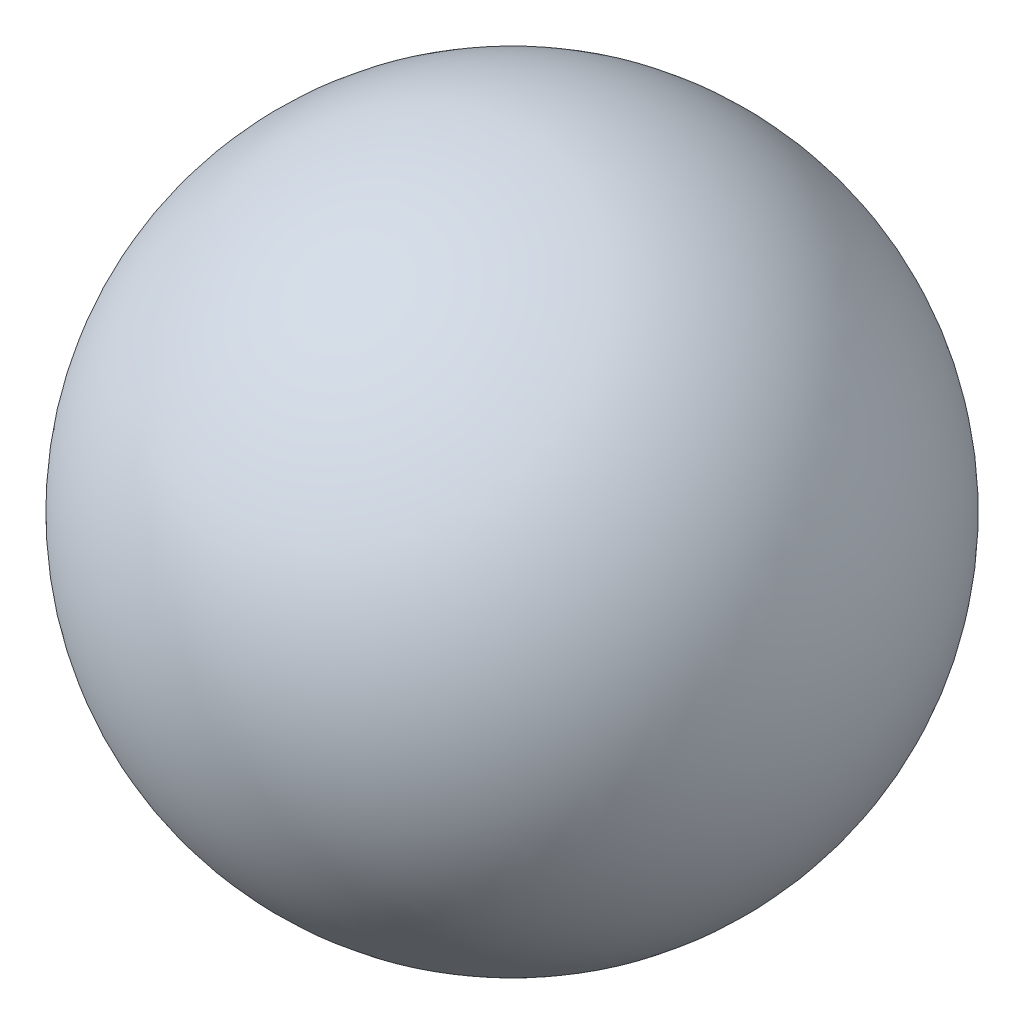
ISO-10303-21;
HEADER;
FILE_DESCRIPTION(('STEP AP214'),'2;1');
FILE_NAME('part.step','',(''),(''),'','','');
FILE_SCHEMA(('AUTOMOTIVE_DESIGN { 1 0 10303 214 1 1 1 1 }'));
ENDSEC;
DATA;
#1=APPLICATION_CONTEXT('core data for automotive mechanical design processes');
#2=APPLICATION_PROTOCOL_DEFINITION('international standard','automotive_design',2000,#1);
#3=PRODUCT_CONTEXT('',#1,'mechanical');
#4=PRODUCT('Part','Part','',(#3));
#5=PRODUCT_RELATED_PRODUCT_CATEGORY('part','',(#4));
#6=PRODUCT_DEFINITION_FORMATION('','',#4);
#7=PRODUCT_DEFINITION_CONTEXT('part definition',#1,'design');
#8=PRODUCT_DEFINITION('design','',#6,#7);
#9=PRODUCT_DEFINITION_SHAPE('','',#8);
#10=(LENGTH_UNIT() NAMED_UNIT(*) SI_UNIT(.MILLI.,.METRE.));
#11=(NAMED_UNIT(*) PLANE_ANGLE_UNIT() SI_UNIT($,.RADIAN.));
#12=(NAMED_UNIT(*) SI_UNIT($,.STERADIAN.) SOLID_ANGLE_UNIT());
#13=UNCERTAINTY_MEASURE_WITH_UNIT(LENGTH_MEASURE(1.E-05),#10,'distance_accuracy_value','');
#14=(GEOMETRIC_REPRESENTATION_CONTEXT(3) GLOBAL_UNCERTAINTY_ASSIGNED_CONTEXT((#13)) GLOBAL_UNIT_ASSIGNED_CONTEXT((#10,
#11,#12)) REPRESENTATION_CONTEXT('',''));
#15=CARTESIAN_POINT('',(0.,0.,0.));
#16=DIRECTION('',(0.,0.,1.));
#17=DIRECTION('',(1.,0.,0.));
#18=AXIS2_PLACEMENT_3D('',#15,#16,#17);
#19=CARTESIAN_POINT('',(0.,0.,0.));
#20=DIRECTION('',(0.,1.,0.));
#21=DIRECTION('',(-1.,0.,0.));
#22=AXIS2_PLACEMENT_3D('',#19,#20,#21);
#23=SPHERICAL_SURFACE('',#22,10.);
#24=CARTESIAN_POINT('',(0.,10.,0.));
#25=VERTEX_POINT('',#24);
#26=VERTEX_LOOP('',#25);
#27=FACE_BOUND('',#26,.T.);
#28=ADVANCED_FACE('F45',(#27),#23,.T.);
#29=CLOSED_SHELL('',(#28));
#30=MANIFOLD_SOLID_BREP('B2',#29);
#31=CARTESIAN_POINT('',(0.,0.,2.5));
#32=DIRECTION('',(0.,0.,-1.));
#33=DIRECTION('',(-1.,0.,0.));
#34=AXIS2_PLACEMENT_3D('',#31,#32,#33);
#35=CYLINDRICAL_SURFACE('',#34,2.5);
#36=CARTESIAN_POINT('',(0.,0.,-2.5));
#37=DIRECTION('',(0.,0.,-1.));
#38=DIRECTION('',(1.,0.,0.));
#39=AXIS2_PLACEMENT_3D('',#36,#37,#38);
#40=CIRCLE('',#39,2.5);
#41=CARTESIAN_POINT('',(2.5,0.,-2.5));
#42=VERTEX_POINT('',#41);
#43=CARTESIAN_POINT('',(-2.5,0.,-2.5));
#44=VERTEX_POINT('',#43);
#45=EDGE_CURVE('E168',#42,#44,#40,.T.);
#46=ORIENTED_EDGE('',*,*,#45,.T.);
#47=DIRECTION('',(0.,0.,-1.));
#48=VECTOR('',#47,1.);
#49=CARTESIAN_POINT('',(-2.5,0.,2.5));
#50=LINE('',#49,#48);
#51=CARTESIAN_POINT('',(-2.5,0.,2.5));
#52=VERTEX_POINT('',#51);
#53=EDGE_CURVE('E43',#52,#44,#50,.T.);
#54=ORIENTED_EDGE('',*,*,#53,.F.);
#55=CARTESIAN_POINT('',(0.,0.,2.5));
#56=DIRECTION('',(0.,0.,-1.));
#57=DIRECTION('',(1.,0.,0.));
#58=AXIS2_PLACEMENT_3D('',#55,#56,#57);
#59=CIRCLE('',#58,2.5);
#60=CARTESIAN_POINT('',(2.5,0.,2.5));
#61=VERTEX_POINT('',#60);
#62=EDGE_CURVE('E188',#61,#52,#59,.T.);
#63=ORIENTED_EDGE('',*,*,#62,.F.);
#64=DIRECTION('',(0.,0.,-1.));
#65=VECTOR('',#64,1.);
#66=CARTESIAN_POINT('',(2.5,0.,2.5));
#67=LINE('',#66,#65);
#68=EDGE_CURVE('E164',#61,#42,#67,.T.);
#69=ORIENTED_EDGE('',*,*,#68,.T.);
#70=EDGE_LOOP('',(#46,#54,#63,#69));
#71=FACE_BOUND('',#70,.T.);
#72=ADVANCED_FACE('F59',(#71),#35,.F.);
#73=CARTESIAN_POINT('',(-2.5,5.00000000000002,2.5));
#74=DIRECTION('',(-1.,0.,0.));
#75=DIRECTION('',(0.,-1.,0.));
#76=AXIS2_PLACEMENT_3D('',#73,#74,#75);
#77=PLANE('',#76);
#78=DIRECTION('',(0.,1.,0.));
#79=VECTOR('',#78,1.);
#80=CARTESIAN_POINT('',(-2.5,5.00000000000002,-2.5));
#81=LINE('',#80,#79);
#82=CARTESIAN_POINT('',(-2.5,5.00000000000002,-2.5));
#83=VERTEX_POINT('',#82);
#84=EDGE_CURVE('E172',#44,#83,#81,.T.);
#85=ORIENTED_EDGE('',*,*,#84,.T.);
#86=DIRECTION('',(0.,0.,-1.));
#87=VECTOR('',#86,1.);
#88=CARTESIAN_POINT('',(-2.5,5.00000000000002,2.5));
#89=LINE('',#88,#87);
#90=CARTESIAN_POINT('',(-2.5,5.00000000000002,2.5));
#91=VERTEX_POINT('',#90);
#92=EDGE_CURVE('E67',#91,#83,#89,.T.);
#93=ORIENTED_EDGE('',*,*,#92,.F.);
#94=DIRECTION('',(0.,1.,0.));
#95=VECTOR('',#94,1.);
#96=CARTESIAN_POINT('',(-2.5,5.00000000000002,2.5));
#97=LINE('',#96,#95);
#98=EDGE_CURVE('E124',#52,#91,#97,.T.);
#99=ORIENTED_EDGE('',*,*,#98,.F.);
#100=ORIENTED_EDGE('',*,*,#53,.T.);
#101=EDGE_LOOP('',(#85,#93,#99,#100));
#102=FACE_BOUND('',#101,.T.);
#103=ADVANCED_FACE('F237',(#102),#77,.F.);
#104=CARTESIAN_POINT('',(-5.,5.00000000000002,2.5));
#105=DIRECTION('',(0.,-1.,0.));
#106=DIRECTION('',(0.,0.,-1.));
#107=AXIS2_PLACEMENT_3D('',#104,#105,#106);
#108=PLANE('',#107);
#109=DIRECTION('',(-1.,0.,0.));
#110=VECTOR('',#109,1.);
#111=CARTESIAN_POINT('',(-5.,5.00000000000002,-2.5));
#112=LINE('',#111,#110);
#113=CARTESIAN_POINT('',(-5.,5.00000000000002,-2.5));
#114=VERTEX_POINT('',#113);
#115=EDGE_CURVE('E174',#83,#114,#112,.T.);
#116=ORIENTED_EDGE('',*,*,#115,.T.);
#117=DIRECTION('',(0.,0.,-1.));
#118=VECTOR('',#117,1.);
#119=CARTESIAN_POINT('',(-5.,5.00000000000002,2.5));
#120=LINE('',#119,#118);
#121=CARTESIAN_POINT('',(-5.,5.00000000000002,2.5));
#122=VERTEX_POINT('',#121);
#123=EDGE_CURVE('E201',#122,#114,#120,.T.);
#124=ORIENTED_EDGE('',*,*,#123,.F.);
#125=DIRECTION('',(-1.,0.,0.));
#126=VECTOR('',#125,1.);
#127=CARTESIAN_POINT('',(-5.,5.00000000000002,2.5));
#128=LINE('',#127,#126);
#129=EDGE_CURVE('E209',#91,#122,#128,.T.);
#130=ORIENTED_EDGE('',*,*,#129,.F.);
#131=ORIENTED_EDGE('',*,*,#92,.T.);
#132=EDGE_LOOP('',(#116,#124,#130,#131));
#133=FACE_BOUND('',#132,.T.);
#134=ADVANCED_FACE('F207',(#133),#108,.F.);
#135=CARTESIAN_POINT('',(-5.,0.,2.5));
#136=DIRECTION('',(1.,0.,0.));
#137=DIRECTION('',(0.,1.,0.));
#138=AXIS2_PLACEMENT_3D('',#135,#136,#137);
#139=PLANE('',#138);
#140=DIRECTION('',(0.,-1.,0.));
#141=VECTOR('',#140,1.);
#142=CARTESIAN_POINT('',(-5.,0.,-2.5));
#143=LINE('',#142,#141);
#144=CARTESIAN_POINT('',(-5.,0.,-2.5));
#145=VERTEX_POINT('',#144);
#146=EDGE_CURVE('E176',#114,#145,#143,.T.);
#147=ORIENTED_EDGE('',*,*,#146,.T.);
#148=DIRECTION('',(0.,0.,-1.));
#149=VECTOR('',#148,1.);
#150=CARTESIAN_POINT('',(-5.,0.,2.5));
#151=LINE('',#150,#149);
#152=CARTESIAN_POINT('',(-5.,0.,2.5));
#153=VERTEX_POINT('',#152);
#154=EDGE_CURVE('E198',#153,#145,#151,.T.);
#155=ORIENTED_EDGE('',*,*,#154,.F.);
#156=DIRECTION('',(0.,-1.,0.));
#157=VECTOR('',#156,1.);
#158=CARTESIAN_POINT('',(-5.,0.,2.5));
#159=LINE('',#158,#157);
#160=EDGE_CURVE('E227',#122,#153,#159,.T.);
#161=ORIENTED_EDGE('',*,*,#160,.F.);
#162=ORIENTED_EDGE('',*,*,#123,.T.);
#163=EDGE_LOOP('',(#147,#155,#161,#162));
#164=FACE_BOUND('',#163,.T.);
#165=ADVANCED_FACE('F218',(#164),#139,.F.);
#166=CARTESIAN_POINT('',(0.,0.,2.5));
#167=DIRECTION('',(0.,0.,-1.));
#168=DIRECTION('',(-1.,0.,0.));
#169=AXIS2_PLACEMENT_3D('',#166,#167,#168);
#170=CYLINDRICAL_SURFACE('',#169,5.);
#171=CARTESIAN_POINT('',(0.,0.,-2.5));
#172=DIRECTION('',(0.,0.,1.));
#173=DIRECTION('',(1.,0.,0.));
#174=AXIS2_PLACEMENT_3D('',#171,#172,#173);
#175=CIRCLE('',#174,5.);
#176=CARTESIAN_POINT('',(2.5,-4.33012701892219,-2.5));
#177=VERTEX_POINT('',#176);
#178=EDGE_CURVE('E178',#145,#177,#175,.T.);
#179=ORIENTED_EDGE('',*,*,#178,.T.);
#180=DIRECTION('',(0.,0.,-1.));
#181=VECTOR('',#180,1.);
#182=CARTESIAN_POINT('',(2.5,-4.33012701892219,2.5));
#183=LINE('',#182,#181);
#184=CARTESIAN_POINT('',(2.5,-4.33012701892219,2.5));
#185=VERTEX_POINT('',#184);
#186=EDGE_CURVE('E195',#185,#177,#183,.T.);
#187=ORIENTED_EDGE('',*,*,#186,.F.);
#188=CARTESIAN_POINT('',(0.,0.,2.5));
#189=DIRECTION('',(0.,0.,1.));
#190=DIRECTION('',(1.,0.,0.));
#191=AXIS2_PLACEMENT_3D('',#188,#189,#190);
#192=CIRCLE('',#191,5.);
#193=EDGE_CURVE('E224',#153,#185,#192,.T.);
#194=ORIENTED_EDGE('',*,*,#193,.F.);
#195=ORIENTED_EDGE('',*,*,#154,.T.);
#196=EDGE_LOOP('',(#179,#187,#194,#195));
#197=FACE_BOUND('',#196,.T.);
#198=ADVANCED_FACE('F222',(#197),#170,.T.);
#199=CARTESIAN_POINT('',(2.5,-5.,2.5));
#200=DIRECTION('',(1.,0.,0.));
#201=DIRECTION('',(0.,0.,-1.));
#202=AXIS2_PLACEMENT_3D('',#199,#200,#201);
#203=PLANE('',#202);
#204=DIRECTION('',(0.,-1.,0.));
#205=VECTOR('',#204,1.);
#206=CARTESIAN_POINT('',(2.5,-5.,-2.5));
#207=LINE('',#206,#205);
#208=CARTESIAN_POINT('',(2.5,-5.,-2.5));
#209=VERTEX_POINT('',#208);
#210=EDGE_CURVE('E181',#177,#209,#207,.T.);
#211=ORIENTED_EDGE('',*,*,#210,.T.);
#212=DIRECTION('',(0.,0.,-1.));
#213=VECTOR('',#212,1.);
#214=CARTESIAN_POINT('',(2.5,-5.,2.5));
#215=LINE('',#214,#213);
#216=CARTESIAN_POINT('',(2.5,-5.,2.5));
#217=VERTEX_POINT('',#216);
#218=EDGE_CURVE('E192',#217,#209,#215,.T.);
#219=ORIENTED_EDGE('',*,*,#218,.F.);
#220=DIRECTION('',(0.,-1.,0.));
#221=VECTOR('',#220,1.);
#222=CARTESIAN_POINT('',(2.5,-5.,2.5));
#223=LINE('',#222,#221);
#224=EDGE_CURVE('E226',#185,#217,#223,.T.);
#225=ORIENTED_EDGE('',*,*,#224,.F.);
#226=ORIENTED_EDGE('',*,*,#186,.T.);
#227=EDGE_LOOP('',(#211,#219,#225,#226));
#228=FACE_BOUND('',#227,.T.);
#229=ADVANCED_FACE('F249',(#228),#203,.F.);
#230=CARTESIAN_POINT('',(5.,-5.,2.5));
#231=DIRECTION('',(0.,1.,0.));
#232=DIRECTION('',(0.,0.,1.));
#233=AXIS2_PLACEMENT_3D('',#230,#231,#232);
#234=PLANE('',#233);
#235=DIRECTION('',(1.,0.,0.));
#236=VECTOR('',#235,1.);
#237=CARTESIAN_POINT('',(5.,-5.,-2.5));
#238=LINE('',#237,#236);
#239=CARTESIAN_POINT('',(5.,-5.,-2.5));
#240=VERTEX_POINT('',#239);
#241=EDGE_CURVE('E183',#209,#240,#238,.T.);
#242=ORIENTED_EDGE('',*,*,#241,.T.);
#243=DIRECTION('',(0.,0.,-1.));
#244=VECTOR('',#243,1.);
#245=CARTESIAN_POINT('',(5.,-5.,2.5));
#246=LINE('',#245,#244);
#247=CARTESIAN_POINT('',(5.,-5.,2.5));
#248=VERTEX_POINT('',#247);
#249=EDGE_CURVE('E158',#248,#240,#246,.T.);
#250=ORIENTED_EDGE('',*,*,#249,.F.);
#251=DIRECTION('',(1.,0.,0.));
#252=VECTOR('',#251,1.);
#253=CARTESIAN_POINT('',(5.,-5.,2.5));
#254=LINE('',#253,#252);
#255=EDGE_CURVE('E149',#217,#248,#254,.T.);
#256=ORIENTED_EDGE('',*,*,#255,.F.);
#257=ORIENTED_EDGE('',*,*,#218,.T.);
#258=EDGE_LOOP('',(#242,#250,#256,#257));
#259=FACE_BOUND('',#258,.T.);
#260=ADVANCED_FACE('F252',(#259),#234,.F.);
#261=CARTESIAN_POINT('',(5.,5.00000000000002,2.5));
#262=DIRECTION('',(-1.,0.,0.));
#263=DIRECTION('',(0.,0.,1.));
#264=AXIS2_PLACEMENT_3D('',#261,#262,#263);
#265=PLANE('',#264);
#266=DIRECTION('',(0.,1.,0.));
#267=VECTOR('',#266,1.);
#268=CARTESIAN_POINT('',(5.,5.00000000000002,-2.5));
#269=LINE('',#268,#267);
#270=CARTESIAN_POINT('',(5.,5.00000000000002,-2.5));
#271=VERTEX_POINT('',#270);
#272=EDGE_CURVE('E157',#240,#271,#269,.T.);
#273=ORIENTED_EDGE('',*,*,#272,.T.);
#274=DIRECTION('',(0.,0.,-1.));
#275=VECTOR('',#274,1.);
#276=CARTESIAN_POINT('',(5.,5.00000000000002,2.5));
#277=LINE('',#276,#275);
#278=CARTESIAN_POINT('',(5.,5.00000000000002,2.5));
#279=VERTEX_POINT('',#278);
#280=EDGE_CURVE('E154',#279,#271,#277,.T.);
#281=ORIENTED_EDGE('',*,*,#280,.F.);
#282=DIRECTION('',(0.,1.,0.));
#283=VECTOR('',#282,1.);
#284=CARTESIAN_POINT('',(5.,5.00000000000002,2.5));
#285=LINE('',#284,#283);
#286=EDGE_CURVE('E143',#248,#279,#285,.T.);
#287=ORIENTED_EDGE('',*,*,#286,.F.);
#288=ORIENTED_EDGE('',*,*,#249,.T.);
#289=EDGE_LOOP('',(#273,#281,#287,#288));
#290=FACE_BOUND('',#289,.T.);
#291=ADVANCED_FACE('F155',(#290),#265,.F.);
#292=CARTESIAN_POINT('',(2.5,5.00000000000002,2.5));
#293=DIRECTION('',(0.,-1.,0.));
#294=DIRECTION('',(0.,0.,-1.));
#295=AXIS2_PLACEMENT_3D('',#292,#293,#294);
#296=PLANE('',#295);
#297=DIRECTION('',(-1.,0.,0.));
#298=VECTOR('',#297,1.);
#299=CARTESIAN_POINT('',(2.5,5.00000000000002,-2.5));
#300=LINE('',#299,#298);
#301=CARTESIAN_POINT('',(2.5,5.00000000000002,-2.5));
#302=VERTEX_POINT('',#301);
#303=EDGE_CURVE('E110',#271,#302,#300,.T.);
#304=ORIENTED_EDGE('',*,*,#303,.T.);
#305=DIRECTION('',(0.,0.,-1.));
#306=VECTOR('',#305,1.);
#307=CARTESIAN_POINT('',(2.5,5.00000000000002,2.5));
#308=LINE('',#307,#306);
#309=CARTESIAN_POINT('',(2.5,5.00000000000002,2.5));
#310=VERTEX_POINT('',#309);
#311=EDGE_CURVE('E159',#310,#302,#308,.T.);
#312=ORIENTED_EDGE('',*,*,#311,.F.);
#313=DIRECTION('',(-1.,0.,0.));
#314=VECTOR('',#313,1.);
#315=CARTESIAN_POINT('',(2.5,5.00000000000002,2.5));
#316=LINE('',#315,#314);
#317=EDGE_CURVE('E147',#279,#310,#316,.T.);
#318=ORIENTED_EDGE('',*,*,#317,.F.);
#319=ORIENTED_EDGE('',*,*,#280,.T.);
#320=EDGE_LOOP('',(#304,#312,#318,#319));
#321=FACE_BOUND('',#320,.T.);
#322=ADVANCED_FACE('F161',(#321),#296,.F.);
#323=CARTESIAN_POINT('',(2.5,0.,2.5));
#324=DIRECTION('',(1.,0.,0.));
#325=DIRECTION('',(0.,1.,0.));
#326=AXIS2_PLACEMENT_3D('',#323,#324,#325);
#327=PLANE('',#326);
#328=DIRECTION('',(0.,-1.,0.));
#329=VECTOR('',#328,1.);
#330=CARTESIAN_POINT('',(2.5,0.,-2.5));
#331=LINE('',#330,#329);
#332=EDGE_CURVE('E116',#302,#42,#331,.T.);
#333=ORIENTED_EDGE('',*,*,#332,.T.);
#334=ORIENTED_EDGE('',*,*,#68,.F.);
#335=DIRECTION('',(0.,-1.,0.));
#336=VECTOR('',#335,1.);
#337=CARTESIAN_POINT('',(2.5,0.,2.5));
#338=LINE('',#337,#336);
#339=EDGE_CURVE('E75',#310,#61,#338,.T.);
#340=ORIENTED_EDGE('',*,*,#339,.F.);
#341=ORIENTED_EDGE('',*,*,#311,.T.);
#342=EDGE_LOOP('',(#333,#334,#340,#341));
#343=FACE_BOUND('',#342,.T.);
#344=ADVANCED_FACE('F261',(#343),#327,.F.);
#345=CARTESIAN_POINT('',(0.,0.,2.5));
#346=DIRECTION('',(0.,0.,1.));
#347=DIRECTION('',(1.,0.,0.));
#348=AXIS2_PLACEMENT_3D('',#345,#346,#347);
#349=PLANE('',#348);
#350=ORIENTED_EDGE('',*,*,#62,.T.);
#351=ORIENTED_EDGE('',*,*,#98,.T.);
#352=ORIENTED_EDGE('',*,*,#129,.T.);
#353=ORIENTED_EDGE('',*,*,#160,.T.);
#354=ORIENTED_EDGE('',*,*,#193,.T.);
#355=ORIENTED_EDGE('',*,*,#224,.T.);
#356=ORIENTED_EDGE('',*,*,#255,.T.);
#357=ORIENTED_EDGE('',*,*,#286,.T.);
#358=ORIENTED_EDGE('',*,*,#317,.T.);
#359=ORIENTED_EDGE('',*,*,#339,.T.);
#360=EDGE_LOOP('',(#350,#351,#352,#353,#354,#355,#356,#357,#358,#359));
#361=FACE_BOUND('',#360,.T.);
#362=ADVANCED_FACE('F145',(#361),#349,.T.);
#363=CARTESIAN_POINT('',(0.,0.,-2.5));
#364=DIRECTION('',(0.,0.,1.));
#365=DIRECTION('',(1.,0.,0.));
#366=AXIS2_PLACEMENT_3D('',#363,#364,#365);
#367=PLANE('',#366);
#368=ORIENTED_EDGE('',*,*,#45,.F.);
#369=ORIENTED_EDGE('',*,*,#332,.F.);
#370=ORIENTED_EDGE('',*,*,#303,.F.);
#371=ORIENTED_EDGE('',*,*,#272,.F.);
#372=ORIENTED_EDGE('',*,*,#241,.F.);
#373=ORIENTED_EDGE('',*,*,#210,.F.);
#374=ORIENTED_EDGE('',*,*,#178,.F.);
#375=ORIENTED_EDGE('',*,*,#146,.F.);
#376=ORIENTED_EDGE('',*,*,#115,.F.);
#377=ORIENTED_EDGE('',*,*,#84,.F.);
#378=EDGE_LOOP('',(#368,#369,#370,#371,#372,#373,#374,#375,#376,#377));
#379=FACE_BOUND('',#378,.T.);
#380=ADVANCED_FACE('F213',(#379),#367,.F.);
#381=CLOSED_SHELL('',(#72,#103,#134,#165,#198,#229,#260,#291,#322,#344,#362,#380));
#382=MANIFOLD_SOLID_BREP('B6',#381);
#383=ADVANCED_BREP_SHAPE_REPRESENTATION('',(#18,#30,#382),#14);
#384=SHAPE_DEFINITION_REPRESENTATION(#9,#383);
ENDSEC;
END-ISO-10303-21;
